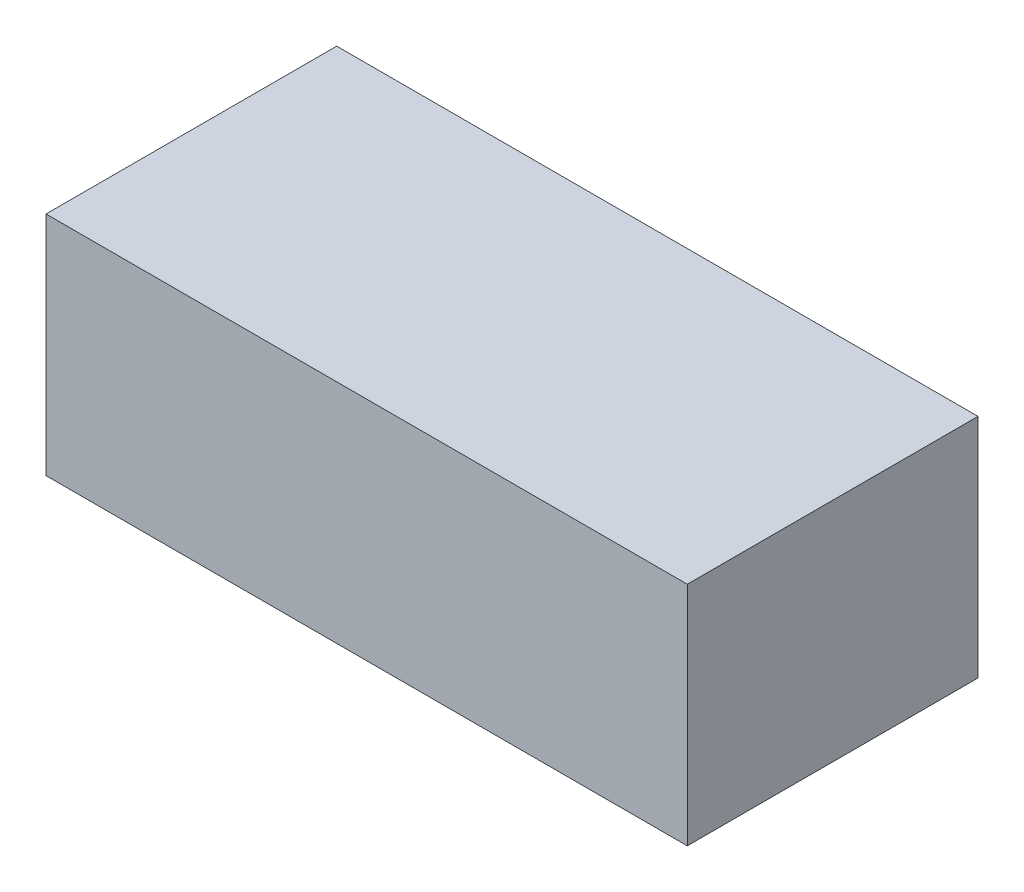
ISO-10303-21;
HEADER;
FILE_DESCRIPTION(('STEP AP214'),'2;1');
FILE_NAME('part.step','',(''),(''),'','','');
FILE_SCHEMA(('AUTOMOTIVE_DESIGN { 1 0 10303 214 1 1 1 1 }'));
ENDSEC;
DATA;
#1=APPLICATION_CONTEXT('core data for automotive mechanical design processes');
#2=APPLICATION_PROTOCOL_DEFINITION('international standard','automotive_design',2000,#1);
#3=PRODUCT_CONTEXT('',#1,'mechanical');
#4=PRODUCT('Part','Part','',(#3));
#5=PRODUCT_RELATED_PRODUCT_CATEGORY('part','',(#4));
#6=PRODUCT_DEFINITION_FORMATION('','',#4);
#7=PRODUCT_DEFINITION_CONTEXT('part definition',#1,'design');
#8=PRODUCT_DEFINITION('design','',#6,#7);
#9=PRODUCT_DEFINITION_SHAPE('','',#8);
#10=(LENGTH_UNIT() NAMED_UNIT(*) SI_UNIT(.MILLI.,.METRE.));
#11=(NAMED_UNIT(*) PLANE_ANGLE_UNIT() SI_UNIT($,.RADIAN.));
#12=(NAMED_UNIT(*) SI_UNIT($,.STERADIAN.) SOLID_ANGLE_UNIT());
#13=UNCERTAINTY_MEASURE_WITH_UNIT(LENGTH_MEASURE(1.E-05),#10,'distance_accuracy_value','');
#14=(GEOMETRIC_REPRESENTATION_CONTEXT(3) GLOBAL_UNCERTAINTY_ASSIGNED_CONTEXT((#13)) GLOBAL_UNIT_ASSIGNED_CONTEXT((#10,
#11,#12)) REPRESENTATION_CONTEXT('',''));
#15=CARTESIAN_POINT('',(0.,0.,0.));
#16=DIRECTION('',(0.,0.,1.));
#17=DIRECTION('',(1.,0.,0.));
#18=AXIS2_PLACEMENT_3D('',#15,#16,#17);
#19=CARTESIAN_POINT('',(37.5,26.5,17.));
#20=DIRECTION('',(-1.,0.,0.));
#21=DIRECTION('',(0.,0.,1.));
#22=AXIS2_PLACEMENT_3D('',#19,#20,#21);
#23=PLANE('',#22);
#24=DIRECTION('',(0.,0.,-1.));
#25=VECTOR('',#24,1.);
#26=CARTESIAN_POINT('',(37.5,0.,17.));
#27=LINE('',#26,#25);
#28=CARTESIAN_POINT('',(37.5,0.,17.));
#29=VERTEX_POINT('',#28);
#30=CARTESIAN_POINT('',(37.5,0.,-17.));
#31=VERTEX_POINT('',#30);
#32=EDGE_CURVE('E110',#29,#31,#27,.T.);
#33=ORIENTED_EDGE('',*,*,#32,.T.);
#34=DIRECTION('',(0.,-1.,0.));
#35=VECTOR('',#34,1.);
#36=CARTESIAN_POINT('',(37.5,26.5,-17.));
#37=LINE('',#36,#35);
#38=CARTESIAN_POINT('',(37.5,26.5,-17.));
#39=VERTEX_POINT('',#38);
#40=EDGE_CURVE('E11',#39,#31,#37,.T.);
#41=ORIENTED_EDGE('',*,*,#40,.F.);
#42=DIRECTION('',(0.,0.,-1.));
#43=VECTOR('',#42,1.);
#44=CARTESIAN_POINT('',(37.5,26.5,17.));
#45=LINE('',#44,#43);
#46=CARTESIAN_POINT('',(37.5,26.5,17.));
#47=VERTEX_POINT('',#46);
#48=EDGE_CURVE('E94',#47,#39,#45,.T.);
#49=ORIENTED_EDGE('',*,*,#48,.F.);
#50=DIRECTION('',(0.,-1.,0.));
#51=VECTOR('',#50,1.);
#52=CARTESIAN_POINT('',(37.5,26.5,17.));
#53=LINE('',#52,#51);
#54=EDGE_CURVE('E106',#47,#29,#53,.T.);
#55=ORIENTED_EDGE('',*,*,#54,.T.);
#56=EDGE_LOOP('',(#33,#41,#49,#55));
#57=FACE_BOUND('',#56,.T.);
#58=ADVANCED_FACE('F42',(#57),#23,.F.);
#59=CARTESIAN_POINT('',(-37.5,26.5,-17.));
#60=DIRECTION('',(0.,0.,1.));
#61=DIRECTION('',(1.,0.,0.));
#62=AXIS2_PLACEMENT_3D('',#59,#60,#61);
#63=PLANE('',#62);
#64=DIRECTION('',(-1.,0.,0.));
#65=VECTOR('',#64,1.);
#66=CARTESIAN_POINT('',(-37.5,0.,-17.));
#67=LINE('',#66,#65);
#68=CARTESIAN_POINT('',(-37.5,0.,-17.));
#69=VERTEX_POINT('',#68);
#70=EDGE_CURVE('E99',#31,#69,#67,.T.);
#71=ORIENTED_EDGE('',*,*,#70,.T.);
#72=DIRECTION('',(0.,-1.,0.));
#73=VECTOR('',#72,1.);
#74=CARTESIAN_POINT('',(-37.5,26.5,-17.));
#75=LINE('',#74,#73);
#76=CARTESIAN_POINT('',(-37.5,26.5,-17.));
#77=VERTEX_POINT('',#76);
#78=EDGE_CURVE('E51',#77,#69,#75,.T.);
#79=ORIENTED_EDGE('',*,*,#78,.F.);
#80=DIRECTION('',(-1.,0.,0.));
#81=VECTOR('',#80,1.);
#82=CARTESIAN_POINT('',(-37.5,26.5,-17.));
#83=LINE('',#82,#81);
#84=EDGE_CURVE('E89',#39,#77,#83,.T.);
#85=ORIENTED_EDGE('',*,*,#84,.F.);
#86=ORIENTED_EDGE('',*,*,#40,.T.);
#87=EDGE_LOOP('',(#71,#79,#85,#86));
#88=FACE_BOUND('',#87,.T.);
#89=ADVANCED_FACE('F98',(#88),#63,.F.);
#90=CARTESIAN_POINT('',(-37.5,26.5,17.));
#91=DIRECTION('',(1.,0.,0.));
#92=DIRECTION('',(0.,0.,-1.));
#93=AXIS2_PLACEMENT_3D('',#90,#91,#92);
#94=PLANE('',#93);
#95=DIRECTION('',(0.,0.,1.));
#96=VECTOR('',#95,1.);
#97=CARTESIAN_POINT('',(-37.5,0.,17.));
#98=LINE('',#97,#96);
#99=CARTESIAN_POINT('',(-37.5,0.,17.));
#100=VERTEX_POINT('',#99);
#101=EDGE_CURVE('E76',#69,#100,#98,.T.);
#102=ORIENTED_EDGE('',*,*,#101,.T.);
#103=DIRECTION('',(0.,-1.,0.));
#104=VECTOR('',#103,1.);
#105=CARTESIAN_POINT('',(-37.5,26.5,17.));
#106=LINE('',#105,#104);
#107=CARTESIAN_POINT('',(-37.5,26.5,17.));
#108=VERTEX_POINT('',#107);
#109=EDGE_CURVE('E101',#108,#100,#106,.T.);
#110=ORIENTED_EDGE('',*,*,#109,.F.);
#111=DIRECTION('',(0.,0.,1.));
#112=VECTOR('',#111,1.);
#113=CARTESIAN_POINT('',(-37.5,26.5,17.));
#114=LINE('',#113,#112);
#115=EDGE_CURVE('E92',#77,#108,#114,.T.);
#116=ORIENTED_EDGE('',*,*,#115,.F.);
#117=ORIENTED_EDGE('',*,*,#78,.T.);
#118=EDGE_LOOP('',(#102,#110,#116,#117));
#119=FACE_BOUND('',#118,.T.);
#120=ADVANCED_FACE('F102',(#119),#94,.F.);
#121=CARTESIAN_POINT('',(-37.5,26.5,17.));
#122=DIRECTION('',(0.,0.,-1.));
#123=DIRECTION('',(-1.,0.,0.));
#124=AXIS2_PLACEMENT_3D('',#121,#122,#123);
#125=PLANE('',#124);
#126=DIRECTION('',(1.,0.,0.));
#127=VECTOR('',#126,1.);
#128=CARTESIAN_POINT('',(-37.5,0.,17.));
#129=LINE('',#128,#127);
#130=EDGE_CURVE('E82',#100,#29,#129,.T.);
#131=ORIENTED_EDGE('',*,*,#130,.T.);
#132=ORIENTED_EDGE('',*,*,#54,.F.);
#133=DIRECTION('',(1.,0.,0.));
#134=VECTOR('',#133,1.);
#135=CARTESIAN_POINT('',(-37.5,26.5,17.));
#136=LINE('',#135,#134);
#137=EDGE_CURVE('E59',#108,#47,#136,.T.);
#138=ORIENTED_EDGE('',*,*,#137,.F.);
#139=ORIENTED_EDGE('',*,*,#109,.T.);
#140=EDGE_LOOP('',(#131,#132,#138,#139));
#141=FACE_BOUND('',#140,.T.);
#142=ADVANCED_FACE('F123',(#141),#125,.F.);
#143=CARTESIAN_POINT('',(0.,26.5,0.));
#144=DIRECTION('',(0.,-1.,0.));
#145=DIRECTION('',(0.,0.,-1.));
#146=AXIS2_PLACEMENT_3D('',#143,#144,#145);
#147=PLANE('',#146);
#148=ORIENTED_EDGE('',*,*,#48,.T.);
#149=ORIENTED_EDGE('',*,*,#84,.T.);
#150=ORIENTED_EDGE('',*,*,#115,.T.);
#151=ORIENTED_EDGE('',*,*,#137,.T.);
#152=EDGE_LOOP('',(#148,#149,#150,#151));
#153=FACE_BOUND('',#152,.T.);
#154=ADVANCED_FACE('F90',(#153),#147,.F.);
#155=CARTESIAN_POINT('',(0.,0.,0.));
#156=DIRECTION('',(0.,-1.,0.));
#157=DIRECTION('',(0.,0.,-1.));
#158=AXIS2_PLACEMENT_3D('',#155,#156,#157);
#159=PLANE('',#158);
#160=ORIENTED_EDGE('',*,*,#32,.F.);
#161=ORIENTED_EDGE('',*,*,#130,.F.);
#162=ORIENTED_EDGE('',*,*,#101,.F.);
#163=ORIENTED_EDGE('',*,*,#70,.F.);
#164=EDGE_LOOP('',(#160,#161,#162,#163));
#165=FACE_BOUND('',#164,.T.);
#166=ADVANCED_FACE('F126',(#165),#159,.T.);
#167=CLOSED_SHELL('',(#58,#89,#120,#142,#154,#166));
#168=MANIFOLD_SOLID_BREP('B2',#167);
#169=ADVANCED_BREP_SHAPE_REPRESENTATION('',(#18,#168),#14);
#170=SHAPE_DEFINITION_REPRESENTATION(#9,#169);
ENDSEC;
END-ISO-10303-21;
